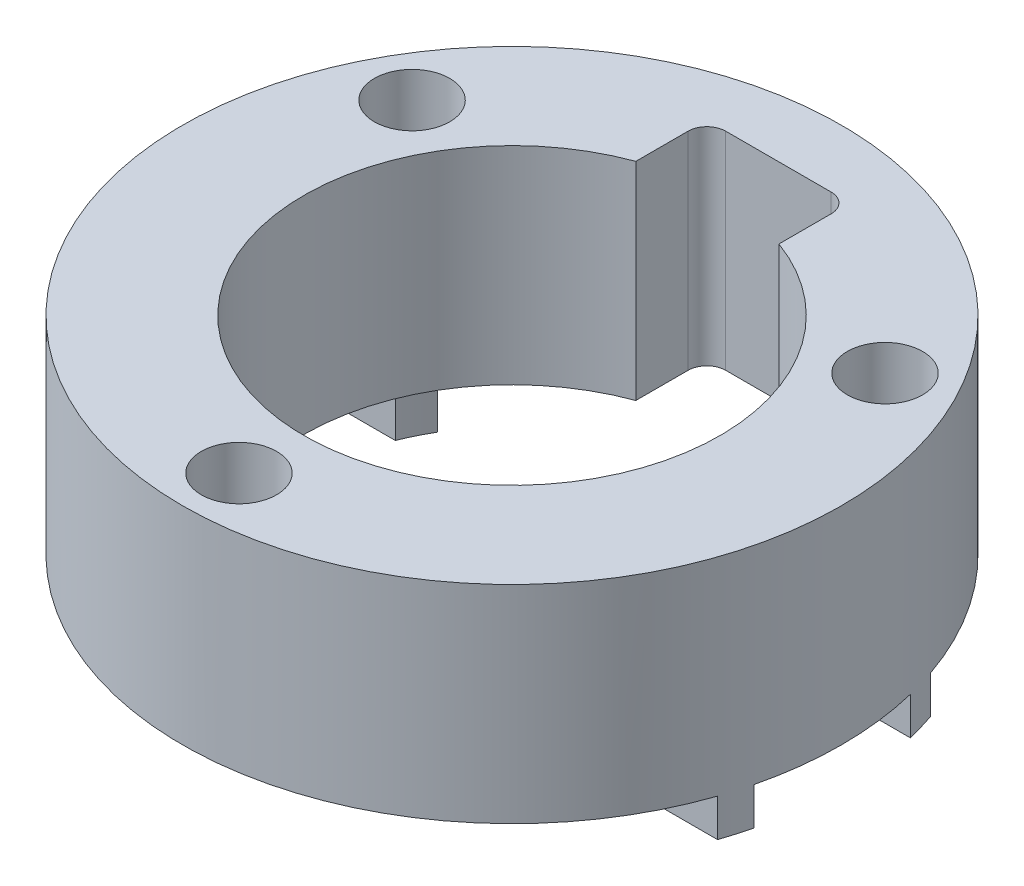
ISO-10303-21;
HEADER;
FILE_DESCRIPTION(('STEP AP214'),'2;1');
FILE_NAME('part.step','',(''),(''),'','','');
FILE_SCHEMA(('AUTOMOTIVE_DESIGN { 1 0 10303 214 1 1 1 1 }'));
ENDSEC;
DATA;
#1=APPLICATION_CONTEXT('core data for automotive mechanical design processes');
#2=APPLICATION_PROTOCOL_DEFINITION('international standard','automotive_design',2000,#1);
#3=PRODUCT_CONTEXT('',#1,'mechanical');
#4=PRODUCT('Part','Part','',(#3));
#5=PRODUCT_RELATED_PRODUCT_CATEGORY('part','',(#4));
#6=PRODUCT_DEFINITION_FORMATION('','',#4);
#7=PRODUCT_DEFINITION_CONTEXT('part definition',#1,'design');
#8=PRODUCT_DEFINITION('design','',#6,#7);
#9=PRODUCT_DEFINITION_SHAPE('','',#8);
#10=(LENGTH_UNIT() NAMED_UNIT(*) SI_UNIT(.MILLI.,.METRE.));
#11=(NAMED_UNIT(*) PLANE_ANGLE_UNIT() SI_UNIT($,.RADIAN.));
#12=(NAMED_UNIT(*) SI_UNIT($,.STERADIAN.) SOLID_ANGLE_UNIT());
#13=UNCERTAINTY_MEASURE_WITH_UNIT(LENGTH_MEASURE(1.E-05),#10,'distance_accuracy_value','');
#14=(GEOMETRIC_REPRESENTATION_CONTEXT(3) GLOBAL_UNCERTAINTY_ASSIGNED_CONTEXT((#13)) GLOBAL_UNIT_ASSIGNED_CONTEXT((#10,
#11,#12)) REPRESENTATION_CONTEXT('',''));
#15=CARTESIAN_POINT('',(0.,0.,0.));
#16=DIRECTION('',(0.,0.,1.));
#17=DIRECTION('',(1.,0.,0.));
#18=AXIS2_PLACEMENT_3D('',#15,#16,#17);
#19=CARTESIAN_POINT('',(0.,11.,0.));
#20=DIRECTION('',(0.,-1.,0.));
#21=DIRECTION('',(0.,0.,-1.));
#22=AXIS2_PLACEMENT_3D('',#19,#20,#21);
#23=CYLINDRICAL_SURFACE('',#22,11.15);
#24=DIRECTION('',(0.,1.,0.));
#25=VECTOR('',#24,1.);
#26=CARTESIAN_POINT('',(9.61249187255838,-2.,5.65));
#27=LINE('',#26,#25);
#28=CARTESIAN_POINT('',(9.61249187255838,-2.,5.65));
#29=VERTEX_POINT('',#28);
#30=CARTESIAN_POINT('',(9.61249187255838,0.,5.65));
#31=VERTEX_POINT('',#30);
#32=EDGE_CURVE('E307',#29,#31,#27,.T.);
#33=ORIENTED_EDGE('',*,*,#32,.T.);
#34=CARTESIAN_POINT('',(0.,0.,0.));
#35=DIRECTION('',(0.,1.,0.));
#36=DIRECTION('',(0.,0.,1.));
#37=AXIS2_PLACEMENT_3D('',#34,#35,#36);
#38=CIRCLE('',#37,11.15);
#39=CARTESIAN_POINT('',(10.3489129863962,0.,4.15));
#40=VERTEX_POINT('',#39);
#41=EDGE_CURVE('E247',#40,#31,#38,.F.);
#42=ORIENTED_EDGE('',*,*,#41,.F.);
#43=DIRECTION('',(0.,1.,0.));
#44=VECTOR('',#43,1.);
#45=CARTESIAN_POINT('',(10.3489129863962,-2.,4.15));
#46=LINE('',#45,#44);
#47=CARTESIAN_POINT('',(10.3489129863962,-2.,4.15));
#48=VERTEX_POINT('',#47);
#49=EDGE_CURVE('E304',#48,#40,#46,.T.);
#50=ORIENTED_EDGE('',*,*,#49,.F.);
#51=CARTESIAN_POINT('',(0.,-2.,0.));
#52=DIRECTION('',(0.,-1.,0.));
#53=DIRECTION('',(0.,0.,-1.));
#54=AXIS2_PLACEMENT_3D('',#51,#52,#53);
#55=CIRCLE('',#54,11.15);
#56=EDGE_CURVE('E295',#29,#48,#55,.F.);
#57=ORIENTED_EDGE('',*,*,#56,.F.);
#58=EDGE_LOOP('',(#33,#42,#50,#57));
#59=FACE_BOUND('',#58,.T.);
#60=ADVANCED_FACE('F36',(#59),#23,.F.);
#61=DIRECTION('',(0.,1.,0.));
#62=VECTOR('',#61,1.);
#63=CARTESIAN_POINT('',(10.3489129863962,-2.,-4.15));
#64=LINE('',#63,#62);
#65=CARTESIAN_POINT('',(10.3489129863962,-2.,-4.15));
#66=VERTEX_POINT('',#65);
#67=CARTESIAN_POINT('',(10.3489129863962,0.,-4.15));
#68=VERTEX_POINT('',#67);
#69=EDGE_CURVE('E59',#66,#68,#64,.T.);
#70=ORIENTED_EDGE('',*,*,#69,.T.);
#71=CARTESIAN_POINT('',(9.6124918725583,0.,-5.65));
#72=VERTEX_POINT('',#71);
#73=EDGE_CURVE('E54',#72,#68,#38,.F.);
#74=ORIENTED_EDGE('',*,*,#73,.F.);
#75=DIRECTION('',(0.,1.,0.));
#76=VECTOR('',#75,1.);
#77=CARTESIAN_POINT('',(9.6124918725583,-2.,-5.65));
#78=LINE('',#77,#76);
#79=CARTESIAN_POINT('',(9.6124918725583,-2.,-5.65));
#80=VERTEX_POINT('',#79);
#81=EDGE_CURVE('E284',#80,#72,#78,.T.);
#82=ORIENTED_EDGE('',*,*,#81,.F.);
#83=CARTESIAN_POINT('',(0.,-2.,0.));
#84=DIRECTION('',(0.,-1.,0.));
#85=DIRECTION('',(0.,0.,-1.));
#86=AXIS2_PLACEMENT_3D('',#83,#84,#85);
#87=CIRCLE('',#86,11.15);
#88=EDGE_CURVE('E257',#66,#80,#87,.F.);
#89=ORIENTED_EDGE('',*,*,#88,.F.);
#90=EDGE_LOOP('',(#70,#74,#82,#89));
#91=FACE_BOUND('',#90,.T.);
#92=ADVANCED_FACE('F539',(#91),#23,.F.);
#93=DIRECTION('',(0.,1.,0.));
#94=VECTOR('',#93,1.);
#95=CARTESIAN_POINT('',(-9.61249187255827,-2.,-5.65));
#96=LINE('',#95,#94);
#97=CARTESIAN_POINT('',(-9.61249187255827,-2.,-5.65));
#98=VERTEX_POINT('',#97);
#99=CARTESIAN_POINT('',(-9.61249187255827,0.,-5.65));
#100=VERTEX_POINT('',#99);
#101=EDGE_CURVE('E337',#98,#100,#96,.T.);
#102=ORIENTED_EDGE('',*,*,#101,.T.);
#103=CARTESIAN_POINT('',(-10.3489129863962,0.,-4.15));
#104=VERTEX_POINT('',#103);
#105=EDGE_CURVE('E239',#104,#100,#38,.F.);
#106=ORIENTED_EDGE('',*,*,#105,.F.);
#107=DIRECTION('',(0.,1.,0.));
#108=VECTOR('',#107,1.);
#109=CARTESIAN_POINT('',(-10.3489129863962,-2.,-4.15));
#110=LINE('',#109,#108);
#111=CARTESIAN_POINT('',(-10.3489129863962,-2.,-4.15));
#112=VERTEX_POINT('',#111);
#113=EDGE_CURVE('E334',#112,#104,#110,.T.);
#114=ORIENTED_EDGE('',*,*,#113,.F.);
#115=CARTESIAN_POINT('',(0.,-2.,0.));
#116=DIRECTION('',(0.,-1.,0.));
#117=DIRECTION('',(0.,0.,-1.));
#118=AXIS2_PLACEMENT_3D('',#115,#116,#117);
#119=CIRCLE('',#118,11.15);
#120=EDGE_CURVE('E322',#98,#112,#119,.F.);
#121=ORIENTED_EDGE('',*,*,#120,.F.);
#122=EDGE_LOOP('',(#102,#106,#114,#121));
#123=FACE_BOUND('',#122,.T.);
#124=ADVANCED_FACE('F461',(#123),#23,.F.);
#125=DIRECTION('',(0.,1.,0.));
#126=VECTOR('',#125,1.);
#127=CARTESIAN_POINT('',(-10.3489129863962,-2.,4.15));
#128=LINE('',#127,#126);
#129=CARTESIAN_POINT('',(-10.3489129863962,-2.,4.15));
#130=VERTEX_POINT('',#129);
#131=CARTESIAN_POINT('',(-10.3489129863962,0.,4.15));
#132=VERTEX_POINT('',#131);
#133=EDGE_CURVE('E372',#130,#132,#128,.T.);
#134=ORIENTED_EDGE('',*,*,#133,.T.);
#135=CARTESIAN_POINT('',(-9.61249187255836,0.,5.65));
#136=VERTEX_POINT('',#135);
#137=EDGE_CURVE('E243',#136,#132,#38,.F.);
#138=ORIENTED_EDGE('',*,*,#137,.F.);
#139=DIRECTION('',(0.,1.,0.));
#140=VECTOR('',#139,1.);
#141=CARTESIAN_POINT('',(-9.61249187255836,-2.,5.65));
#142=LINE('',#141,#140);
#143=CARTESIAN_POINT('',(-9.61249187255836,-2.,5.65));
#144=VERTEX_POINT('',#143);
#145=EDGE_CURVE('E375',#144,#136,#142,.T.);
#146=ORIENTED_EDGE('',*,*,#145,.F.);
#147=CARTESIAN_POINT('',(0.,-2.,0.));
#148=DIRECTION('',(0.,-1.,0.));
#149=DIRECTION('',(0.,0.,-1.));
#150=AXIS2_PLACEMENT_3D('',#147,#148,#149);
#151=CIRCLE('',#150,11.15);
#152=EDGE_CURVE('E353',#130,#144,#151,.F.);
#153=ORIENTED_EDGE('',*,*,#152,.F.);
#154=EDGE_LOOP('',(#134,#138,#146,#153));
#155=FACE_BOUND('',#154,.T.);
#156=ADVANCED_FACE('F414',(#155),#23,.F.);
#157=CARTESIAN_POINT('',(0.,0.,0.));
#158=DIRECTION('',(0.,1.,0.));
#159=DIRECTION('',(0.,0.,1.));
#160=AXIS2_PLACEMENT_3D('',#157,#158,#159);
#161=PLANE('',#160);
#162=CARTESIAN_POINT('',(0.,0.,0.));
#163=DIRECTION('',(0.,1.,0.));
#164=DIRECTION('',(0.,0.,1.));
#165=AXIS2_PLACEMENT_3D('',#162,#163,#164);
#166=CIRCLE('',#165,11.05);
#167=CARTESIAN_POINT('',(-3.8,0.,-10.3760541633128));
#168=VERTEX_POINT('',#167);
#169=CARTESIAN_POINT('',(3.8,0.,-10.3760541633128));
#170=VERTEX_POINT('',#169);
#171=EDGE_CURVE('E218',#168,#170,#166,.T.);
#172=ORIENTED_EDGE('',*,*,#171,.T.);
#173=DIRECTION('',(0.,0.,-1.));
#174=VECTOR('',#173,1.);
#175=CARTESIAN_POINT('',(3.8,0.,0.));
#176=LINE('',#175,#174);
#177=CARTESIAN_POINT('',(3.8,0.,-13.15));
#178=VERTEX_POINT('',#177);
#179=EDGE_CURVE('E226',#170,#178,#176,.T.);
#180=ORIENTED_EDGE('',*,*,#179,.T.);
#181=CARTESIAN_POINT('',(2.8,0.,-13.15));
#182=DIRECTION('',(0.,1.,0.));
#183=DIRECTION('',(0.,0.,1.));
#184=AXIS2_PLACEMENT_3D('',#181,#182,#183);
#185=CIRCLE('',#184,1.);
#186=CARTESIAN_POINT('',(2.8,0.,-14.15));
#187=VERTEX_POINT('',#186);
#188=EDGE_CURVE('E509',#187,#178,#185,.F.);
#189=ORIENTED_EDGE('',*,*,#188,.F.);
#190=DIRECTION('',(1.,0.,0.));
#191=VECTOR('',#190,1.);
#192=CARTESIAN_POINT('',(0.,0.,-14.15));
#193=LINE('',#192,#191);
#194=CARTESIAN_POINT('',(-2.8,0.,-14.15));
#195=VERTEX_POINT('',#194);
#196=EDGE_CURVE('E507',#195,#187,#193,.T.);
#197=ORIENTED_EDGE('',*,*,#196,.F.);
#198=CARTESIAN_POINT('',(-2.8,0.,-13.15));
#199=DIRECTION('',(0.,1.,0.));
#200=DIRECTION('',(0.,0.,1.));
#201=AXIS2_PLACEMENT_3D('',#198,#199,#200);
#202=CIRCLE('',#201,1.);
#203=CARTESIAN_POINT('',(-3.8,0.,-13.15));
#204=VERTEX_POINT('',#203);
#205=EDGE_CURVE('E222',#195,#204,#202,.T.);
#206=ORIENTED_EDGE('',*,*,#205,.T.);
#207=DIRECTION('',(0.,0.,-1.));
#208=VECTOR('',#207,1.);
#209=CARTESIAN_POINT('',(-3.8,0.,0.));
#210=LINE('',#209,#208);
#211=EDGE_CURVE('E212',#168,#204,#210,.T.);
#212=ORIENTED_EDGE('',*,*,#211,.F.);
#213=EDGE_LOOP('',(#172,#180,#189,#197,#206,#212));
#214=FACE_BOUND('',#213,.T.);
#215=CARTESIAN_POINT('',(-14.325,0.,0.));
#216=DIRECTION('',(0.,-1.,0.));
#217=DIRECTION('',(0.,0.,-1.));
#218=AXIS2_PLACEMENT_3D('',#215,#216,#217);
#219=CIRCLE('',#218,1.99999999999998);
#220=CARTESIAN_POINT('',(-14.325,0.,-1.99999999999998));
#221=VERTEX_POINT('',#220);
#222=EDGE_CURVE('E955',#221,#221,#219,.T.);
#223=ORIENTED_EDGE('',*,*,#222,.F.);
#224=EDGE_LOOP('',(#223));
#225=FACE_BOUND('',#224,.T.);
#226=DIRECTION('',(-1.,0.,0.));
#227=VECTOR('',#226,1.);
#228=CARTESIAN_POINT('',(0.,0.,-4.15));
#229=LINE('',#228,#227);
#230=CARTESIAN_POINT('',(-17.0008088042893,0.,-4.15));
#231=VERTEX_POINT('',#230);
#232=EDGE_CURVE('E317',#104,#231,#229,.T.);
#233=ORIENTED_EDGE('',*,*,#232,.F.);
#234=ORIENTED_EDGE('',*,*,#105,.T.);
#235=DIRECTION('',(1.,0.,0.));
#236=VECTOR('',#235,1.);
#237=CARTESIAN_POINT('',(0.,0.,-5.65));
#238=LINE('',#237,#236);
#239=CARTESIAN_POINT('',(-11.3573683548744,0.,-5.65));
#240=VERTEX_POINT('',#239);
#241=EDGE_CURVE('E329',#240,#100,#238,.T.);
#242=ORIENTED_EDGE('',*,*,#241,.F.);
#243=CARTESIAN_POINT('',(-12.5573683548743,0.,-7.25000000000004));
#244=DIRECTION('',(0.,1.,0.));
#245=DIRECTION('',(0.,0.,1.));
#246=AXIS2_PLACEMENT_3D('',#243,#244,#245);
#247=CIRCLE('',#246,2.);
#248=CARTESIAN_POINT('',(-13.7573683548742,0.,-5.65));
#249=VERTEX_POINT('',#248);
#250=EDGE_CURVE('E448',#240,#249,#247,.T.);
#251=ORIENTED_EDGE('',*,*,#250,.T.);
#252=CARTESIAN_POINT('',(-16.5628349022744,0.,-5.65));
#253=VERTEX_POINT('',#252);
#254=EDGE_CURVE('E312',#253,#249,#238,.T.);
#255=ORIENTED_EDGE('',*,*,#254,.F.);
#256=CARTESIAN_POINT('',(0.,0.,0.));
#257=DIRECTION('',(0.,1.,0.));
#258=DIRECTION('',(0.,0.,1.));
#259=AXIS2_PLACEMENT_3D('',#256,#257,#258);
#260=CIRCLE('',#259,17.5);
#261=CARTESIAN_POINT('',(16.5628349022744,0.,-5.65000000000001));
#262=VERTEX_POINT('',#261);
#263=EDGE_CURVE('E40',#262,#253,#260,.T.);
#264=ORIENTED_EDGE('',*,*,#263,.F.);
#265=DIRECTION('',(-1.,0.,0.));
#266=VECTOR('',#265,1.);
#267=CARTESIAN_POINT('',(0.,0.,-5.65));
#268=LINE('',#267,#266);
#269=CARTESIAN_POINT('',(13.7573683548743,0.,-5.65));
#270=VERTEX_POINT('',#269);
#271=EDGE_CURVE('E258',#262,#270,#268,.T.);
#272=ORIENTED_EDGE('',*,*,#271,.T.);
#273=CARTESIAN_POINT('',(12.5573683548743,0.,-7.25000000000004));
#274=DIRECTION('',(0.,1.,0.));
#275=DIRECTION('',(0.,0.,1.));
#276=AXIS2_PLACEMENT_3D('',#273,#274,#275);
#277=CIRCLE('',#276,2.);
#278=CARTESIAN_POINT('',(11.3573683548744,0.,-5.65));
#279=VERTEX_POINT('',#278);
#280=EDGE_CURVE('E488',#270,#279,#277,.T.);
#281=ORIENTED_EDGE('',*,*,#280,.T.);
#282=EDGE_CURVE('E271',#279,#72,#268,.T.);
#283=ORIENTED_EDGE('',*,*,#282,.T.);
#284=ORIENTED_EDGE('',*,*,#73,.T.);
#285=DIRECTION('',(1.,0.,0.));
#286=VECTOR('',#285,1.);
#287=CARTESIAN_POINT('',(0.,0.,-4.15));
#288=LINE('',#287,#286);
#289=CARTESIAN_POINT('',(17.0008088042893,0.,-4.15));
#290=VERTEX_POINT('',#289);
#291=EDGE_CURVE('E269',#68,#290,#288,.T.);
#292=ORIENTED_EDGE('',*,*,#291,.T.);
#293=CARTESIAN_POINT('',(17.0008088042893,0.,4.15));
#294=VERTEX_POINT('',#293);
#295=EDGE_CURVE('E378',#294,#290,#260,.T.);
#296=ORIENTED_EDGE('',*,*,#295,.F.);
#297=DIRECTION('',(1.,0.,0.));
#298=VECTOR('',#297,1.);
#299=CARTESIAN_POINT('',(0.,0.,4.15));
#300=LINE('',#299,#298);
#301=EDGE_CURVE('E293',#40,#294,#300,.T.);
#302=ORIENTED_EDGE('',*,*,#301,.F.);
#303=ORIENTED_EDGE('',*,*,#41,.T.);
#304=DIRECTION('',(-1.,0.,0.));
#305=VECTOR('',#304,1.);
#306=CARTESIAN_POINT('',(0.,0.,5.65));
#307=LINE('',#306,#305);
#308=CARTESIAN_POINT('',(16.5628349022745,0.,5.65));
#309=VERTEX_POINT('',#308);
#310=EDGE_CURVE('E288',#309,#31,#307,.T.);
#311=ORIENTED_EDGE('',*,*,#310,.F.);
#312=CARTESIAN_POINT('',(-16.5628349022744,0.,5.65));
#313=VERTEX_POINT('',#312);
#314=EDGE_CURVE('E382',#313,#309,#260,.T.);
#315=ORIENTED_EDGE('',*,*,#314,.F.);
#316=DIRECTION('',(1.,0.,0.));
#317=VECTOR('',#316,1.);
#318=CARTESIAN_POINT('',(0.,0.,5.65));
#319=LINE('',#318,#317);
#320=EDGE_CURVE('E354',#313,#136,#319,.T.);
#321=ORIENTED_EDGE('',*,*,#320,.T.);
#322=ORIENTED_EDGE('',*,*,#137,.T.);
#323=DIRECTION('',(-1.,0.,0.));
#324=VECTOR('',#323,1.);
#325=CARTESIAN_POINT('',(0.,0.,4.15));
#326=LINE('',#325,#324);
#327=CARTESIAN_POINT('',(-17.0008088042893,0.,4.15));
#328=VERTEX_POINT('',#327);
#329=EDGE_CURVE('E349',#132,#328,#326,.T.);
#330=ORIENTED_EDGE('',*,*,#329,.T.);
#331=EDGE_CURVE('E225',#231,#328,#260,.T.);
#332=ORIENTED_EDGE('',*,*,#331,.F.);
#333=EDGE_LOOP('',(#233,#234,#242,#251,#255,#264,#272,#281,#283,#284,#292,#296,#302,#303,#311,
#315,#321,#322,#330,#332));
#334=FACE_BOUND('',#333,.T.);
#335=CARTESIAN_POINT('',(0.,0.,14.5));
#336=DIRECTION('',(0.,1.,0.));
#337=DIRECTION('',(0.,0.,1.));
#338=AXIS2_PLACEMENT_3D('',#335,#336,#337);
#339=CIRCLE('',#338,2.);
#340=CARTESIAN_POINT('',(0.,0.,16.5));
#341=VERTEX_POINT('',#340);
#342=EDGE_CURVE('E475',#341,#341,#339,.T.);
#343=ORIENTED_EDGE('',*,*,#342,.T.);
#344=EDGE_LOOP('',(#343));
#345=FACE_BOUND('',#344,.T.);
#346=CARTESIAN_POINT('',(14.325,0.,0.));
#347=DIRECTION('',(0.,1.,0.));
#348=DIRECTION('',(0.,0.,1.));
#349=AXIS2_PLACEMENT_3D('',#346,#347,#348);
#350=CIRCLE('',#349,2.);
#351=CARTESIAN_POINT('',(14.325,0.,2.00000000000006));
#352=VERTEX_POINT('',#351);
#353=EDGE_CURVE('E478',#352,#352,#350,.T.);
#354=ORIENTED_EDGE('',*,*,#353,.T.);
#355=EDGE_LOOP('',(#354));
#356=FACE_BOUND('',#355,.T.);
#357=ADVANCED_FACE('F214',(#214,#225,#334,#345,#356),#161,.F.);
#358=CARTESIAN_POINT('',(-2.8,11.,-13.15));
#359=DIRECTION('',(0.,-1.,0.));
#360=DIRECTION('',(0.,0.,-1.));
#361=AXIS2_PLACEMENT_3D('',#358,#359,#360);
#362=CYLINDRICAL_SURFACE('',#361,1.);
#363=ORIENTED_EDGE('',*,*,#205,.F.);
#364=DIRECTION('',(0.,-1.,0.));
#365=VECTOR('',#364,1.);
#366=CARTESIAN_POINT('',(-2.8,11.,-14.15));
#367=LINE('',#366,#365);
#368=CARTESIAN_POINT('',(-2.8,11.,-14.15));
#369=VERTEX_POINT('',#368);
#370=EDGE_CURVE('E11',#369,#195,#367,.T.);
#371=ORIENTED_EDGE('',*,*,#370,.F.);
#372=CARTESIAN_POINT('',(-2.8,11.,-13.15));
#373=DIRECTION('',(0.,1.,0.));
#374=DIRECTION('',(0.,0.,1.));
#375=AXIS2_PLACEMENT_3D('',#372,#373,#374);
#376=CIRCLE('',#375,1.);
#377=CARTESIAN_POINT('',(-3.8,11.,-13.15));
#378=VERTEX_POINT('',#377);
#379=EDGE_CURVE('E388',#369,#378,#376,.T.);
#380=ORIENTED_EDGE('',*,*,#379,.T.);
#381=DIRECTION('',(0.,-1.,0.));
#382=VECTOR('',#381,1.);
#383=CARTESIAN_POINT('',(-3.8,11.,-13.15));
#384=LINE('',#383,#382);
#385=EDGE_CURVE('E505',#378,#204,#384,.T.);
#386=ORIENTED_EDGE('',*,*,#385,.T.);
#387=EDGE_LOOP('',(#363,#371,#380,#386));
#388=FACE_BOUND('',#387,.T.);
#389=ADVANCED_FACE('F38',(#388),#362,.F.);
#390=CARTESIAN_POINT('',(0.,11.,-14.15));
#391=DIRECTION('',(0.,0.,-1.));
#392=DIRECTION('',(-1.,0.,0.));
#393=AXIS2_PLACEMENT_3D('',#390,#391,#392);
#394=PLANE('',#393);
#395=ORIENTED_EDGE('',*,*,#196,.T.);
#396=DIRECTION('',(0.,-1.,0.));
#397=VECTOR('',#396,1.);
#398=CARTESIAN_POINT('',(2.8,11.,-14.15));
#399=LINE('',#398,#397);
#400=CARTESIAN_POINT('',(2.8,11.,-14.15));
#401=VERTEX_POINT('',#400);
#402=EDGE_CURVE('E46',#401,#187,#399,.T.);
#403=ORIENTED_EDGE('',*,*,#402,.F.);
#404=DIRECTION('',(1.,0.,0.));
#405=VECTOR('',#404,1.);
#406=CARTESIAN_POINT('',(0.,11.,-14.15));
#407=LINE('',#406,#405);
#408=EDGE_CURVE('E494',#369,#401,#407,.T.);
#409=ORIENTED_EDGE('',*,*,#408,.F.);
#410=ORIENTED_EDGE('',*,*,#370,.T.);
#411=EDGE_LOOP('',(#395,#403,#409,#410));
#412=FACE_BOUND('',#411,.T.);
#413=ADVANCED_FACE('F530',(#412),#394,.F.);
#414=CARTESIAN_POINT('',(2.8,11.,-13.15));
#415=DIRECTION('',(0.,-1.,0.));
#416=DIRECTION('',(0.,0.,-1.));
#417=AXIS2_PLACEMENT_3D('',#414,#415,#416);
#418=CYLINDRICAL_SURFACE('',#417,1.);
#419=ORIENTED_EDGE('',*,*,#188,.T.);
#420=DIRECTION('',(0.,-1.,0.));
#421=VECTOR('',#420,1.);
#422=CARTESIAN_POINT('',(3.8,11.,-13.15));
#423=LINE('',#422,#421);
#424=CARTESIAN_POINT('',(3.8,11.,-13.15));
#425=VERTEX_POINT('',#424);
#426=EDGE_CURVE('E514',#425,#178,#423,.T.);
#427=ORIENTED_EDGE('',*,*,#426,.F.);
#428=CARTESIAN_POINT('',(2.8,11.,-13.15));
#429=DIRECTION('',(0.,1.,0.));
#430=DIRECTION('',(0.,0.,1.));
#431=AXIS2_PLACEMENT_3D('',#428,#429,#430);
#432=CIRCLE('',#431,1.);
#433=EDGE_CURVE('E496',#401,#425,#432,.F.);
#434=ORIENTED_EDGE('',*,*,#433,.F.);
#435=ORIENTED_EDGE('',*,*,#402,.T.);
#436=EDGE_LOOP('',(#419,#427,#434,#435));
#437=FACE_BOUND('',#436,.T.);
#438=ADVANCED_FACE('F520',(#437),#418,.F.);
#439=CARTESIAN_POINT('',(3.8,11.,0.));
#440=DIRECTION('',(-1.,0.,0.));
#441=DIRECTION('',(0.,0.,1.));
#442=AXIS2_PLACEMENT_3D('',#439,#440,#441);
#443=PLANE('',#442);
#444=ORIENTED_EDGE('',*,*,#179,.F.);
#445=DIRECTION('',(0.,1.,0.));
#446=VECTOR('',#445,1.);
#447=CARTESIAN_POINT('',(3.8,0.,-10.3760541633128));
#448=LINE('',#447,#446);
#449=CARTESIAN_POINT('',(3.8,11.,-10.3760541633128));
#450=VERTEX_POINT('',#449);
#451=EDGE_CURVE('E235',#170,#450,#448,.T.);
#452=ORIENTED_EDGE('',*,*,#451,.T.);
#453=DIRECTION('',(0.,0.,-1.));
#454=VECTOR('',#453,1.);
#455=CARTESIAN_POINT('',(3.8,11.,0.));
#456=LINE('',#455,#454);
#457=EDGE_CURVE('E498',#450,#425,#456,.T.);
#458=ORIENTED_EDGE('',*,*,#457,.T.);
#459=ORIENTED_EDGE('',*,*,#426,.T.);
#460=EDGE_LOOP('',(#444,#452,#458,#459));
#461=FACE_BOUND('',#460,.T.);
#462=ADVANCED_FACE('F525',(#461),#443,.T.);
#463=CARTESIAN_POINT('',(-3.8,11.,0.));
#464=DIRECTION('',(-1.,0.,0.));
#465=DIRECTION('',(0.,0.,1.));
#466=AXIS2_PLACEMENT_3D('',#463,#464,#465);
#467=PLANE('',#466);
#468=ORIENTED_EDGE('',*,*,#211,.T.);
#469=ORIENTED_EDGE('',*,*,#385,.F.);
#470=DIRECTION('',(0.,0.,-1.));
#471=VECTOR('',#470,1.);
#472=CARTESIAN_POINT('',(-3.8,11.,0.));
#473=LINE('',#472,#471);
#474=CARTESIAN_POINT('',(-3.8,11.,-10.3760541633128));
#475=VERTEX_POINT('',#474);
#476=EDGE_CURVE('E231',#475,#378,#473,.T.);
#477=ORIENTED_EDGE('',*,*,#476,.F.);
#478=DIRECTION('',(0.,1.,0.));
#479=VECTOR('',#478,1.);
#480=CARTESIAN_POINT('',(-3.8,0.,-10.3760541633128));
#481=LINE('',#480,#479);
#482=EDGE_CURVE('E229',#168,#475,#481,.T.);
#483=ORIENTED_EDGE('',*,*,#482,.F.);
#484=EDGE_LOOP('',(#468,#469,#477,#483));
#485=FACE_BOUND('',#484,.T.);
#486=ADVANCED_FACE('F230',(#485),#467,.F.);
#487=CARTESIAN_POINT('',(0.,11.,0.));
#488=DIRECTION('',(0.,-1.,0.));
#489=DIRECTION('',(0.,0.,-1.));
#490=AXIS2_PLACEMENT_3D('',#487,#488,#489);
#491=CYLINDRICAL_SURFACE('',#490,17.5);
#492=CARTESIAN_POINT('',(0.,11.,0.));
#493=DIRECTION('',(0.,1.,0.));
#494=DIRECTION('',(0.,0.,1.));
#495=AXIS2_PLACEMENT_3D('',#492,#493,#494);
#496=CIRCLE('',#495,17.5);
#497=CARTESIAN_POINT('',(0.,11.,17.5000000000001));
#498=VERTEX_POINT('',#497);
#499=EDGE_CURVE('E502',#498,#498,#496,.T.);
#500=ORIENTED_EDGE('',*,*,#499,.F.);
#501=EDGE_LOOP('',(#500));
#502=FACE_BOUND('',#501,.T.);
#503=ORIENTED_EDGE('',*,*,#314,.T.);
#504=DIRECTION('',(0.,1.,0.));
#505=VECTOR('',#504,1.);
#506=CARTESIAN_POINT('',(16.5628349022745,-2.,5.65));
#507=LINE('',#506,#505);
#508=CARTESIAN_POINT('',(16.5628349022745,-2.,5.65));
#509=VERTEX_POINT('',#508);
#510=EDGE_CURVE('E310',#509,#309,#507,.T.);
#511=ORIENTED_EDGE('',*,*,#510,.F.);
#512=CARTESIAN_POINT('',(0.,-2.,0.));
#513=DIRECTION('',(0.,-1.,0.));
#514=DIRECTION('',(0.,0.,-1.));
#515=AXIS2_PLACEMENT_3D('',#512,#513,#514);
#516=CIRCLE('',#515,17.5);
#517=CARTESIAN_POINT('',(17.0008088042893,-2.,4.15));
#518=VERTEX_POINT('',#517);
#519=EDGE_CURVE('E289',#518,#509,#516,.T.);
#520=ORIENTED_EDGE('',*,*,#519,.F.);
#521=DIRECTION('',(0.,1.,0.));
#522=VECTOR('',#521,1.);
#523=CARTESIAN_POINT('',(17.0008088042893,-2.,4.15));
#524=LINE('',#523,#522);
#525=EDGE_CURVE('E299',#518,#294,#524,.T.);
#526=ORIENTED_EDGE('',*,*,#525,.T.);
#527=ORIENTED_EDGE('',*,*,#295,.T.);
#528=DIRECTION('',(0.,1.,0.));
#529=VECTOR('',#528,1.);
#530=CARTESIAN_POINT('',(17.0008088042893,-2.,-4.15));
#531=LINE('',#530,#529);
#532=CARTESIAN_POINT('',(17.0008088042893,-2.,-4.15));
#533=VERTEX_POINT('',#532);
#534=EDGE_CURVE('E268',#533,#290,#531,.T.);
#535=ORIENTED_EDGE('',*,*,#534,.F.);
#536=CARTESIAN_POINT('',(0.,-2.,0.));
#537=DIRECTION('',(0.,-1.,0.));
#538=DIRECTION('',(0.,0.,-1.));
#539=AXIS2_PLACEMENT_3D('',#536,#537,#538);
#540=CIRCLE('',#539,17.5);
#541=CARTESIAN_POINT('',(16.5628349022744,-2.,-5.65));
#542=VERTEX_POINT('',#541);
#543=EDGE_CURVE('E266',#542,#533,#540,.T.);
#544=ORIENTED_EDGE('',*,*,#543,.F.);
#545=DIRECTION('',(0.,1.,0.));
#546=VECTOR('',#545,1.);
#547=CARTESIAN_POINT('',(16.5628349022744,-2.,-5.65));
#548=LINE('',#547,#546);
#549=EDGE_CURVE('E275',#542,#262,#548,.T.);
#550=ORIENTED_EDGE('',*,*,#549,.T.);
#551=ORIENTED_EDGE('',*,*,#263,.T.);
#552=DIRECTION('',(0.,1.,0.));
#553=VECTOR('',#552,1.);
#554=CARTESIAN_POINT('',(-16.5628349022744,-2.,-5.65));
#555=LINE('',#554,#553);
#556=CARTESIAN_POINT('',(-16.5628349022744,-2.,-5.65));
#557=VERTEX_POINT('',#556);
#558=EDGE_CURVE('E346',#557,#253,#555,.T.);
#559=ORIENTED_EDGE('',*,*,#558,.F.);
#560=CARTESIAN_POINT('',(0.,-2.,0.));
#561=DIRECTION('',(0.,-1.,0.));
#562=DIRECTION('',(0.,0.,-1.));
#563=AXIS2_PLACEMENT_3D('',#560,#561,#562);
#564=CIRCLE('',#563,17.5);
#565=CARTESIAN_POINT('',(-17.0008088042893,-2.,-4.15));
#566=VERTEX_POINT('',#565);
#567=EDGE_CURVE('E313',#566,#557,#564,.T.);
#568=ORIENTED_EDGE('',*,*,#567,.F.);
#569=DIRECTION('',(0.,1.,0.));
#570=VECTOR('',#569,1.);
#571=CARTESIAN_POINT('',(-17.0008088042893,-2.,-4.15));
#572=LINE('',#571,#570);
#573=EDGE_CURVE('E326',#566,#231,#572,.T.);
#574=ORIENTED_EDGE('',*,*,#573,.T.);
#575=ORIENTED_EDGE('',*,*,#331,.T.);
#576=DIRECTION('',(0.,1.,0.));
#577=VECTOR('',#576,1.);
#578=CARTESIAN_POINT('',(-17.0008088042893,-2.,4.15));
#579=LINE('',#578,#577);
#580=CARTESIAN_POINT('',(-17.0008088042893,-2.,4.15));
#581=VERTEX_POINT('',#580);
#582=EDGE_CURVE('E361',#581,#328,#579,.T.);
#583=ORIENTED_EDGE('',*,*,#582,.F.);
#584=CARTESIAN_POINT('',(0.,-2.,0.));
#585=DIRECTION('',(0.,-1.,0.));
#586=DIRECTION('',(0.,0.,-1.));
#587=AXIS2_PLACEMENT_3D('',#584,#585,#586);
#588=CIRCLE('',#587,17.5);
#589=CARTESIAN_POINT('',(-16.5628349022744,-2.,5.65));
#590=VERTEX_POINT('',#589);
#591=EDGE_CURVE('E359',#590,#581,#588,.T.);
#592=ORIENTED_EDGE('',*,*,#591,.F.);
#593=DIRECTION('',(0.,1.,0.));
#594=VECTOR('',#593,1.);
#595=CARTESIAN_POINT('',(-16.5628349022744,-2.,5.65));
#596=LINE('',#595,#594);
#597=EDGE_CURVE('E393',#590,#313,#596,.T.);
#598=ORIENTED_EDGE('',*,*,#597,.T.);
#599=EDGE_LOOP('',(#503,#511,#520,#526,#527,#535,#544,#550,#551,#559,#568,#574,#575,#583,#592,#598));
#600=FACE_BOUND('',#599,.T.);
#601=ADVANCED_FACE('F421',(#502,#600),#491,.T.);
#602=CARTESIAN_POINT('',(0.,11.,0.));
#603=DIRECTION('',(0.,1.,0.));
#604=DIRECTION('',(0.,0.,1.));
#605=AXIS2_PLACEMENT_3D('',#602,#603,#604);
#606=PLANE('',#605);
#607=CARTESIAN_POINT('',(-12.5573683548743,11.,-7.25000000000004));
#608=DIRECTION('',(0.,1.,0.));
#609=DIRECTION('',(0.,0.,1.));
#610=AXIS2_PLACEMENT_3D('',#607,#608,#609);
#611=CIRCLE('',#610,2.);
#612=CARTESIAN_POINT('',(-12.5573683548743,11.,-5.25000000000004));
#613=VERTEX_POINT('',#612);
#614=EDGE_CURVE('E471',#613,#613,#611,.T.);
#615=ORIENTED_EDGE('',*,*,#614,.F.);
#616=EDGE_LOOP('',(#615));
#617=FACE_BOUND('',#616,.T.);
#618=CARTESIAN_POINT('',(0.,11.,14.5));
#619=DIRECTION('',(0.,1.,0.));
#620=DIRECTION('',(0.,0.,1.));
#621=AXIS2_PLACEMENT_3D('',#618,#619,#620);
#622=CIRCLE('',#621,2.);
#623=CARTESIAN_POINT('',(0.,11.,16.5));
#624=VERTEX_POINT('',#623);
#625=EDGE_CURVE('E482',#624,#624,#622,.T.);
#626=ORIENTED_EDGE('',*,*,#625,.F.);
#627=EDGE_LOOP('',(#626));
#628=FACE_BOUND('',#627,.T.);
#629=CARTESIAN_POINT('',(12.5573683548743,11.,-7.25000000000004));
#630=DIRECTION('',(0.,1.,0.));
#631=DIRECTION('',(0.,0.,1.));
#632=AXIS2_PLACEMENT_3D('',#629,#630,#631);
#633=CIRCLE('',#632,2.);
#634=CARTESIAN_POINT('',(12.5573683548743,11.,-5.25000000000004));
#635=VERTEX_POINT('',#634);
#636=EDGE_CURVE('E485',#635,#635,#633,.T.);
#637=ORIENTED_EDGE('',*,*,#636,.F.);
#638=EDGE_LOOP('',(#637));
#639=FACE_BOUND('',#638,.T.);
#640=ORIENTED_EDGE('',*,*,#379,.F.);
#641=ORIENTED_EDGE('',*,*,#408,.T.);
#642=ORIENTED_EDGE('',*,*,#433,.T.);
#643=ORIENTED_EDGE('',*,*,#457,.F.);
#644=CARTESIAN_POINT('',(0.,11.,0.));
#645=DIRECTION('',(0.,1.,0.));
#646=DIRECTION('',(0.,0.,1.));
#647=AXIS2_PLACEMENT_3D('',#644,#645,#646);
#648=CIRCLE('',#647,11.05);
#649=EDGE_CURVE('E240',#475,#450,#648,.T.);
#650=ORIENTED_EDGE('',*,*,#649,.F.);
#651=ORIENTED_EDGE('',*,*,#476,.T.);
#652=EDGE_LOOP('',(#640,#641,#642,#643,#650,#651));
#653=FACE_BOUND('',#652,.T.);
#654=ORIENTED_EDGE('',*,*,#499,.T.);
#655=EDGE_LOOP('',(#654));
#656=FACE_BOUND('',#655,.T.);
#657=ADVANCED_FACE('F528',(#617,#628,#639,#653,#656),#606,.T.);
#658=CARTESIAN_POINT('',(12.5573683548743,0.,-7.25000000000004));
#659=DIRECTION('',(0.,1.,0.));
#660=DIRECTION('',(0.,0.,1.));
#661=AXIS2_PLACEMENT_3D('',#658,#659,#660);
#662=CYLINDRICAL_SURFACE('',#661,2.);
#663=ORIENTED_EDGE('',*,*,#280,.F.);
#664=DIRECTION('',(0.,1.,0.));
#665=VECTOR('',#664,1.);
#666=CARTESIAN_POINT('',(13.7573683548743,-2.,-5.65));
#667=LINE('',#666,#665);
#668=CARTESIAN_POINT('',(13.7573683548743,-2.,-5.65));
#669=VERTEX_POINT('',#668);
#670=EDGE_CURVE('E278',#669,#270,#667,.T.);
#671=ORIENTED_EDGE('',*,*,#670,.F.);
#672=CARTESIAN_POINT('',(12.5573683548743,-2.,-7.25000000000004));
#673=DIRECTION('',(0.,-1.,0.));
#674=DIRECTION('',(0.,0.,-1.));
#675=AXIS2_PLACEMENT_3D('',#672,#673,#674);
#676=CIRCLE('',#675,2.);
#677=CARTESIAN_POINT('',(11.3573683548744,-2.,-5.65));
#678=VERTEX_POINT('',#677);
#679=EDGE_CURVE('E263',#678,#669,#676,.F.);
#680=ORIENTED_EDGE('',*,*,#679,.F.);
#681=DIRECTION('',(0.,1.,0.));
#682=VECTOR('',#681,1.);
#683=CARTESIAN_POINT('',(11.3573683548744,-2.,-5.65));
#684=LINE('',#683,#682);
#685=EDGE_CURVE('E281',#678,#279,#684,.T.);
#686=ORIENTED_EDGE('',*,*,#685,.T.);
#687=EDGE_LOOP('',(#663,#671,#680,#686));
#688=FACE_BOUND('',#687,.T.);
#689=ORIENTED_EDGE('',*,*,#636,.T.);
#690=EDGE_LOOP('',(#689));
#691=FACE_BOUND('',#690,.T.);
#692=ADVANCED_FACE('F654',(#688,#691),#662,.F.);
#693=CARTESIAN_POINT('',(0.,0.,14.5));
#694=DIRECTION('',(0.,1.,0.));
#695=DIRECTION('',(0.,0.,1.));
#696=AXIS2_PLACEMENT_3D('',#693,#694,#695);
#697=CYLINDRICAL_SURFACE('',#696,2.);
#698=ORIENTED_EDGE('',*,*,#342,.F.);
#699=EDGE_LOOP('',(#698));
#700=FACE_BOUND('',#699,.T.);
#701=ORIENTED_EDGE('',*,*,#625,.T.);
#702=EDGE_LOOP('',(#701));
#703=FACE_BOUND('',#702,.T.);
#704=ADVANCED_FACE('F644',(#700,#703),#697,.F.);
#705=CARTESIAN_POINT('',(-12.5573683548743,0.,-7.25000000000004));
#706=DIRECTION('',(0.,1.,0.));
#707=DIRECTION('',(0.,0.,1.));
#708=AXIS2_PLACEMENT_3D('',#705,#706,#707);
#709=CYLINDRICAL_SURFACE('',#708,2.);
#710=ORIENTED_EDGE('',*,*,#250,.F.);
#711=DIRECTION('',(0.,1.,0.));
#712=VECTOR('',#711,1.);
#713=CARTESIAN_POINT('',(-11.3573683548744,-2.,-5.65));
#714=LINE('',#713,#712);
#715=CARTESIAN_POINT('',(-11.3573683548744,-2.,-5.65));
#716=VERTEX_POINT('',#715);
#717=EDGE_CURVE('E340',#716,#240,#714,.T.);
#718=ORIENTED_EDGE('',*,*,#717,.F.);
#719=CARTESIAN_POINT('',(-12.5573683548743,-2.,-7.25000000000004));
#720=DIRECTION('',(0.,-1.,0.));
#721=DIRECTION('',(0.,0.,-1.));
#722=AXIS2_PLACEMENT_3D('',#719,#720,#721);
#723=CIRCLE('',#722,2.);
#724=CARTESIAN_POINT('',(-13.7573683548742,-2.,-5.65));
#725=VERTEX_POINT('',#724);
#726=EDGE_CURVE('E319',#725,#716,#723,.F.);
#727=ORIENTED_EDGE('',*,*,#726,.F.);
#728=DIRECTION('',(0.,1.,0.));
#729=VECTOR('',#728,1.);
#730=CARTESIAN_POINT('',(-13.7573683548742,-2.,-5.65));
#731=LINE('',#730,#729);
#732=EDGE_CURVE('E343',#725,#249,#731,.T.);
#733=ORIENTED_EDGE('',*,*,#732,.T.);
#734=EDGE_LOOP('',(#710,#718,#727,#733));
#735=FACE_BOUND('',#734,.T.);
#736=ORIENTED_EDGE('',*,*,#614,.T.);
#737=EDGE_LOOP('',(#736));
#738=FACE_BOUND('',#737,.T.);
#739=ADVANCED_FACE('F469',(#735,#738),#709,.F.);
#740=CARTESIAN_POINT('',(14.325,4.,0.));
#741=DIRECTION('',(0.,-1.,0.));
#742=DIRECTION('',(0.,0.,-1.));
#743=AXIS2_PLACEMENT_3D('',#740,#741,#742);
#744=CYLINDRICAL_SURFACE('',#743,2.);
#745=CARTESIAN_POINT('',(14.325,4.,0.));
#746=DIRECTION('',(0.,1.,0.));
#747=DIRECTION('',(0.,0.,1.));
#748=AXIS2_PLACEMENT_3D('',#745,#746,#747);
#749=CIRCLE('',#748,2.);
#750=CARTESIAN_POINT('',(14.325,4.,2.00000000000006));
#751=VERTEX_POINT('',#750);
#752=EDGE_CURVE('E472',#751,#751,#749,.T.);
#753=ORIENTED_EDGE('',*,*,#752,.T.);
#754=EDGE_LOOP('',(#753));
#755=FACE_BOUND('',#754,.T.);
#756=ORIENTED_EDGE('',*,*,#353,.F.);
#757=EDGE_LOOP('',(#756));
#758=FACE_BOUND('',#757,.T.);
#759=ADVANCED_FACE('F643',(#755,#758),#744,.F.);
#760=CARTESIAN_POINT('',(14.325,4.,0.));
#761=DIRECTION('',(0.,1.,0.));
#762=DIRECTION('',(0.,0.,1.));
#763=AXIS2_PLACEMENT_3D('',#760,#761,#762);
#764=PLANE('',#763);
#765=ORIENTED_EDGE('',*,*,#752,.F.);
#766=EDGE_LOOP('',(#765));
#767=FACE_BOUND('',#766,.T.);
#768=ADVANCED_FACE('F693',(#767),#764,.F.);
#769=CARTESIAN_POINT('',(-14.325,4.,0.));
#770=DIRECTION('',(0.,-1.,0.));
#771=DIRECTION('',(0.,0.,-1.));
#772=AXIS2_PLACEMENT_3D('',#769,#770,#771);
#773=CYLINDRICAL_SURFACE('',#772,1.99999999999998);
#774=CARTESIAN_POINT('',(-14.325,4.,0.));
#775=DIRECTION('',(0.,-1.,0.));
#776=DIRECTION('',(0.,0.,-1.));
#777=AXIS2_PLACEMENT_3D('',#774,#775,#776);
#778=CIRCLE('',#777,1.99999999999998);
#779=CARTESIAN_POINT('',(-14.325,4.,-1.99999999999998));
#780=VERTEX_POINT('',#779);
#781=EDGE_CURVE('E374',#780,#780,#778,.T.);
#782=ORIENTED_EDGE('',*,*,#781,.F.);
#783=EDGE_LOOP('',(#782));
#784=FACE_BOUND('',#783,.T.);
#785=ORIENTED_EDGE('',*,*,#222,.T.);
#786=EDGE_LOOP('',(#785));
#787=FACE_BOUND('',#786,.T.);
#788=ADVANCED_FACE('F681',(#784,#787),#773,.F.);
#789=CARTESIAN_POINT('',(-14.325,4.,0.));
#790=DIRECTION('',(0.,-1.,0.));
#791=DIRECTION('',(0.,0.,-1.));
#792=AXIS2_PLACEMENT_3D('',#789,#790,#791);
#793=PLANE('',#792);
#794=ORIENTED_EDGE('',*,*,#781,.T.);
#795=EDGE_LOOP('',(#794));
#796=FACE_BOUND('',#795,.T.);
#797=ADVANCED_FACE('F676',(#796),#793,.T.);
#798=CARTESIAN_POINT('',(0.,-2.,4.15));
#799=DIRECTION('',(0.,0.,-1.));
#800=DIRECTION('',(-1.,0.,0.));
#801=AXIS2_PLACEMENT_3D('',#798,#799,#800);
#802=PLANE('',#801);
#803=ORIENTED_EDGE('',*,*,#329,.F.);
#804=ORIENTED_EDGE('',*,*,#133,.F.);
#805=DIRECTION('',(-1.,0.,0.));
#806=VECTOR('',#805,1.);
#807=CARTESIAN_POINT('',(0.,-2.,4.15));
#808=LINE('',#807,#806);
#809=EDGE_CURVE('E350',#130,#581,#808,.T.);
#810=ORIENTED_EDGE('',*,*,#809,.T.);
#811=ORIENTED_EDGE('',*,*,#582,.T.);
#812=EDGE_LOOP('',(#803,#804,#810,#811));
#813=FACE_BOUND('',#812,.T.);
#814=ADVANCED_FACE('F402',(#813),#802,.T.);
#815=CARTESIAN_POINT('',(0.,-2.,5.65));
#816=DIRECTION('',(0.,0.,1.));
#817=DIRECTION('',(1.,0.,0.));
#818=AXIS2_PLACEMENT_3D('',#815,#816,#817);
#819=PLANE('',#818);
#820=ORIENTED_EDGE('',*,*,#320,.F.);
#821=ORIENTED_EDGE('',*,*,#597,.F.);
#822=DIRECTION('',(1.,0.,0.));
#823=VECTOR('',#822,1.);
#824=CARTESIAN_POINT('',(0.,-2.,5.65));
#825=LINE('',#824,#823);
#826=EDGE_CURVE('E356',#590,#144,#825,.T.);
#827=ORIENTED_EDGE('',*,*,#826,.T.);
#828=ORIENTED_EDGE('',*,*,#145,.T.);
#829=EDGE_LOOP('',(#820,#821,#827,#828));
#830=FACE_BOUND('',#829,.T.);
#831=ADVANCED_FACE('F417',(#830),#819,.T.);
#832=CARTESIAN_POINT('',(0.,-2.,0.));
#833=DIRECTION('',(0.,-1.,0.));
#834=DIRECTION('',(0.,0.,-1.));
#835=AXIS2_PLACEMENT_3D('',#832,#833,#834);
#836=PLANE('',#835);
#837=ORIENTED_EDGE('',*,*,#809,.F.);
#838=ORIENTED_EDGE('',*,*,#152,.T.);
#839=ORIENTED_EDGE('',*,*,#826,.F.);
#840=ORIENTED_EDGE('',*,*,#591,.T.);
#841=EDGE_LOOP('',(#837,#838,#839,#840));
#842=FACE_BOUND('',#841,.T.);
#843=ADVANCED_FACE('F420',(#842),#836,.T.);
#844=CARTESIAN_POINT('',(0.,-2.,-5.65));
#845=DIRECTION('',(0.,0.,1.));
#846=DIRECTION('',(1.,0.,0.));
#847=AXIS2_PLACEMENT_3D('',#844,#845,#846);
#848=PLANE('',#847);
#849=ORIENTED_EDGE('',*,*,#254,.T.);
#850=ORIENTED_EDGE('',*,*,#732,.F.);
#851=DIRECTION('',(1.,0.,0.));
#852=VECTOR('',#851,1.);
#853=CARTESIAN_POINT('',(0.,-2.,-5.65));
#854=LINE('',#853,#852);
#855=EDGE_CURVE('E316',#557,#725,#854,.T.);
#856=ORIENTED_EDGE('',*,*,#855,.F.);
#857=ORIENTED_EDGE('',*,*,#558,.T.);
#858=EDGE_LOOP('',(#849,#850,#856,#857));
#859=FACE_BOUND('',#858,.T.);
#860=ADVANCED_FACE('F451',(#859),#848,.F.);
#861=ORIENTED_EDGE('',*,*,#241,.T.);
#862=ORIENTED_EDGE('',*,*,#101,.F.);
#863=EDGE_CURVE('E320',#716,#98,#854,.T.);
#864=ORIENTED_EDGE('',*,*,#863,.F.);
#865=ORIENTED_EDGE('',*,*,#717,.T.);
#866=EDGE_LOOP('',(#861,#862,#864,#865));
#867=FACE_BOUND('',#866,.T.);
#868=ADVANCED_FACE('F466',(#867),#848,.F.);
#869=CARTESIAN_POINT('',(0.,-2.,-4.15));
#870=DIRECTION('',(0.,0.,-1.));
#871=DIRECTION('',(-1.,0.,0.));
#872=AXIS2_PLACEMENT_3D('',#869,#870,#871);
#873=PLANE('',#872);
#874=ORIENTED_EDGE('',*,*,#232,.T.);
#875=ORIENTED_EDGE('',*,*,#573,.F.);
#876=DIRECTION('',(-1.,0.,0.));
#877=VECTOR('',#876,1.);
#878=CARTESIAN_POINT('',(0.,-2.,-4.15));
#879=LINE('',#878,#877);
#880=EDGE_CURVE('E324',#112,#566,#879,.T.);
#881=ORIENTED_EDGE('',*,*,#880,.F.);
#882=ORIENTED_EDGE('',*,*,#113,.T.);
#883=EDGE_LOOP('',(#874,#875,#881,#882));
#884=FACE_BOUND('',#883,.T.);
#885=ADVANCED_FACE('F458',(#884),#873,.F.);
#886=CARTESIAN_POINT('',(0.,-2.,0.));
#887=DIRECTION('',(0.,-1.,0.));
#888=DIRECTION('',(0.,0.,-1.));
#889=AXIS2_PLACEMENT_3D('',#886,#887,#888);
#890=PLANE('',#889);
#891=ORIENTED_EDGE('',*,*,#567,.T.);
#892=ORIENTED_EDGE('',*,*,#855,.T.);
#893=ORIENTED_EDGE('',*,*,#726,.T.);
#894=ORIENTED_EDGE('',*,*,#863,.T.);
#895=ORIENTED_EDGE('',*,*,#120,.T.);
#896=ORIENTED_EDGE('',*,*,#880,.T.);
#897=EDGE_LOOP('',(#891,#892,#893,#894,#895,#896));
#898=FACE_BOUND('',#897,.T.);
#899=ADVANCED_FACE('F454',(#898),#890,.T.);
#900=CARTESIAN_POINT('',(0.,-2.,5.65));
#901=DIRECTION('',(0.,0.,-1.));
#902=DIRECTION('',(-1.,0.,0.));
#903=AXIS2_PLACEMENT_3D('',#900,#901,#902);
#904=PLANE('',#903);
#905=ORIENTED_EDGE('',*,*,#310,.T.);
#906=ORIENTED_EDGE('',*,*,#32,.F.);
#907=DIRECTION('',(-1.,0.,0.));
#908=VECTOR('',#907,1.);
#909=CARTESIAN_POINT('',(0.,-2.,5.65));
#910=LINE('',#909,#908);
#911=EDGE_CURVE('E292',#509,#29,#910,.T.);
#912=ORIENTED_EDGE('',*,*,#911,.F.);
#913=ORIENTED_EDGE('',*,*,#510,.T.);
#914=EDGE_LOOP('',(#905,#906,#912,#913));
#915=FACE_BOUND('',#914,.T.);
#916=ADVANCED_FACE('F428',(#915),#904,.F.);
#917=CARTESIAN_POINT('',(0.,-2.,4.15));
#918=DIRECTION('',(0.,0.,1.));
#919=DIRECTION('',(1.,0.,0.));
#920=AXIS2_PLACEMENT_3D('',#917,#918,#919);
#921=PLANE('',#920);
#922=ORIENTED_EDGE('',*,*,#301,.T.);
#923=ORIENTED_EDGE('',*,*,#525,.F.);
#924=DIRECTION('',(1.,0.,0.));
#925=VECTOR('',#924,1.);
#926=CARTESIAN_POINT('',(0.,-2.,4.15));
#927=LINE('',#926,#925);
#928=EDGE_CURVE('E297',#48,#518,#927,.T.);
#929=ORIENTED_EDGE('',*,*,#928,.F.);
#930=ORIENTED_EDGE('',*,*,#49,.T.);
#931=EDGE_LOOP('',(#922,#923,#929,#930));
#932=FACE_BOUND('',#931,.T.);
#933=ADVANCED_FACE('F440',(#932),#921,.F.);
#934=CARTESIAN_POINT('',(0.,-2.,0.));
#935=DIRECTION('',(0.,-1.,0.));
#936=DIRECTION('',(0.,0.,-1.));
#937=AXIS2_PLACEMENT_3D('',#934,#935,#936);
#938=PLANE('',#937);
#939=ORIENTED_EDGE('',*,*,#519,.T.);
#940=ORIENTED_EDGE('',*,*,#911,.T.);
#941=ORIENTED_EDGE('',*,*,#56,.T.);
#942=ORIENTED_EDGE('',*,*,#928,.T.);
#943=EDGE_LOOP('',(#939,#940,#941,#942));
#944=FACE_BOUND('',#943,.T.);
#945=ADVANCED_FACE('F434',(#944),#938,.T.);
#946=CARTESIAN_POINT('',(0.,-2.,-4.15));
#947=DIRECTION('',(0.,0.,1.));
#948=DIRECTION('',(1.,0.,0.));
#949=AXIS2_PLACEMENT_3D('',#946,#947,#948);
#950=PLANE('',#949);
#951=ORIENTED_EDGE('',*,*,#291,.F.);
#952=ORIENTED_EDGE('',*,*,#69,.F.);
#953=DIRECTION('',(1.,0.,0.));
#954=VECTOR('',#953,1.);
#955=CARTESIAN_POINT('',(0.,-2.,-4.15));
#956=LINE('',#955,#954);
#957=EDGE_CURVE('E254',#66,#533,#956,.T.);
#958=ORIENTED_EDGE('',*,*,#957,.T.);
#959=ORIENTED_EDGE('',*,*,#534,.T.);
#960=EDGE_LOOP('',(#951,#952,#958,#959));
#961=FACE_BOUND('',#960,.T.);
#962=ADVANCED_FACE('F598',(#961),#950,.T.);
#963=CARTESIAN_POINT('',(0.,-2.,-5.65));
#964=DIRECTION('',(0.,0.,-1.));
#965=DIRECTION('',(-1.,0.,0.));
#966=AXIS2_PLACEMENT_3D('',#963,#964,#965);
#967=PLANE('',#966);
#968=ORIENTED_EDGE('',*,*,#282,.F.);
#969=ORIENTED_EDGE('',*,*,#685,.F.);
#970=DIRECTION('',(-1.,0.,0.));
#971=VECTOR('',#970,1.);
#972=CARTESIAN_POINT('',(0.,-2.,-5.65));
#973=LINE('',#972,#971);
#974=EDGE_CURVE('E260',#678,#80,#973,.T.);
#975=ORIENTED_EDGE('',*,*,#974,.T.);
#976=ORIENTED_EDGE('',*,*,#81,.T.);
#977=EDGE_LOOP('',(#968,#969,#975,#976));
#978=FACE_BOUND('',#977,.T.);
#979=ADVANCED_FACE('F586',(#978),#967,.T.);
#980=ORIENTED_EDGE('',*,*,#271,.F.);
#981=ORIENTED_EDGE('',*,*,#549,.F.);
#982=EDGE_CURVE('E264',#542,#669,#973,.T.);
#983=ORIENTED_EDGE('',*,*,#982,.T.);
#984=ORIENTED_EDGE('',*,*,#670,.T.);
#985=EDGE_LOOP('',(#980,#981,#983,#984));
#986=FACE_BOUND('',#985,.T.);
#987=ADVANCED_FACE('F574',(#986),#967,.T.);
#988=CARTESIAN_POINT('',(0.,-2.,0.));
#989=DIRECTION('',(0.,-1.,0.));
#990=DIRECTION('',(0.,0.,-1.));
#991=AXIS2_PLACEMENT_3D('',#988,#989,#990);
#992=PLANE('',#991);
#993=ORIENTED_EDGE('',*,*,#957,.F.);
#994=ORIENTED_EDGE('',*,*,#88,.T.);
#995=ORIENTED_EDGE('',*,*,#974,.F.);
#996=ORIENTED_EDGE('',*,*,#679,.T.);
#997=ORIENTED_EDGE('',*,*,#982,.F.);
#998=ORIENTED_EDGE('',*,*,#543,.T.);
#999=EDGE_LOOP('',(#993,#994,#995,#996,#997,#998));
#1000=FACE_BOUND('',#999,.T.);
#1001=ADVANCED_FACE('F569',(#1000),#992,.T.);
#1002=CARTESIAN_POINT('',(0.,0.,0.));
#1003=DIRECTION('',(0.,1.,0.));
#1004=DIRECTION('',(0.,0.,1.));
#1005=AXIS2_PLACEMENT_3D('',#1002,#1003,#1004);
#1006=CYLINDRICAL_SURFACE('',#1005,11.05);
#1007=ORIENTED_EDGE('',*,*,#649,.T.);
#1008=ORIENTED_EDGE('',*,*,#451,.F.);
#1009=ORIENTED_EDGE('',*,*,#171,.F.);
#1010=ORIENTED_EDGE('',*,*,#482,.T.);
#1011=EDGE_LOOP('',(#1007,#1008,#1009,#1010));
#1012=FACE_BOUND('',#1011,.T.);
#1013=ADVANCED_FACE('F237',(#1012),#1006,.F.);
#1014=CLOSED_SHELL('',(#60,#92,#124,#156,#357,#389,#413,#438,#462,#486,#601,#657,#692,#704,#739,
#759,#768,#788,#797,#814,#831,#843,#860,#868,#885,#899,#916,#933,#945,#962,#979,#987,#1001,#1013));
#1015=MANIFOLD_SOLID_BREP('B2',#1014);
#1016=ADVANCED_BREP_SHAPE_REPRESENTATION('',(#18,#1015),#14);
#1017=SHAPE_DEFINITION_REPRESENTATION(#9,#1016);
ENDSEC;
END-ISO-10303-21;
